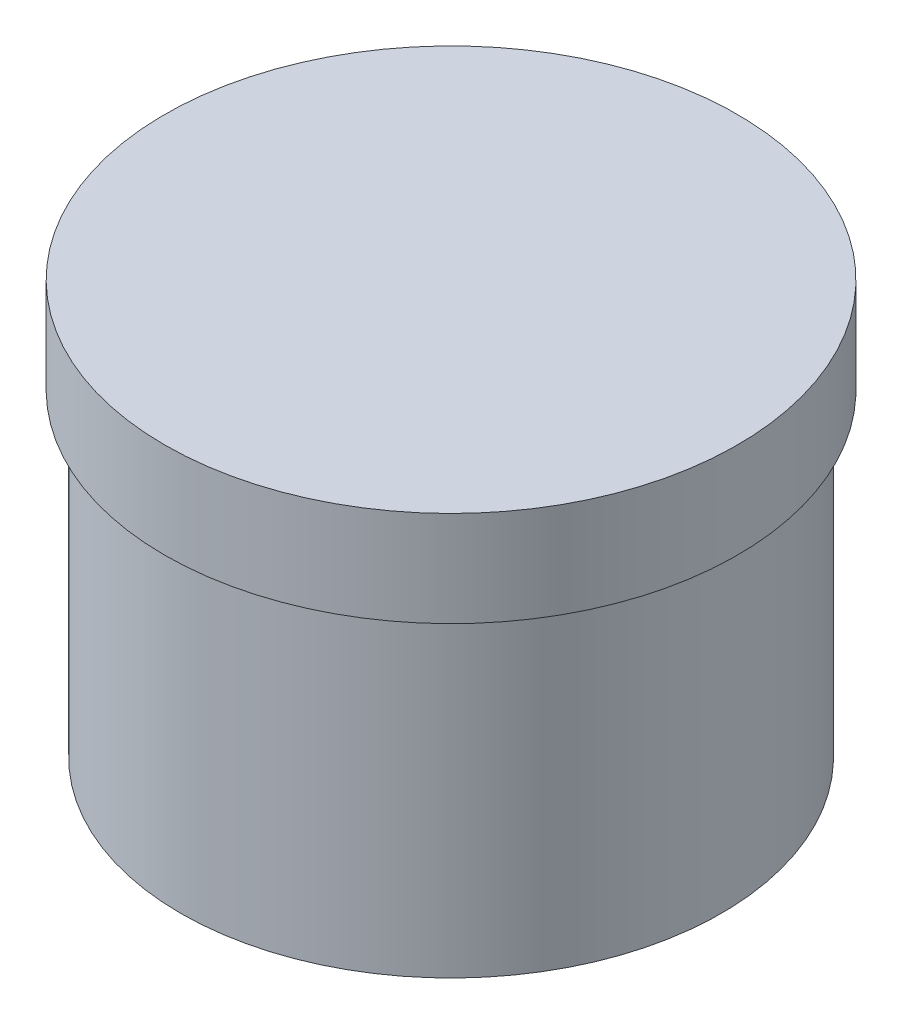
ISO-10303-21;
HEADER;
FILE_DESCRIPTION(('STEP AP214'),'2;1');
FILE_NAME('part.step','',(''),(''),'','','');
FILE_SCHEMA(('AUTOMOTIVE_DESIGN { 1 0 10303 214 1 1 1 1 }'));
ENDSEC;
DATA;
#1=APPLICATION_CONTEXT('core data for automotive mechanical design processes');
#2=APPLICATION_PROTOCOL_DEFINITION('international standard','automotive_design',2000,#1);
#3=PRODUCT_CONTEXT('',#1,'mechanical');
#4=PRODUCT('Part','Part','',(#3));
#5=PRODUCT_RELATED_PRODUCT_CATEGORY('part','',(#4));
#6=PRODUCT_DEFINITION_FORMATION('','',#4);
#7=PRODUCT_DEFINITION_CONTEXT('part definition',#1,'design');
#8=PRODUCT_DEFINITION('design','',#6,#7);
#9=PRODUCT_DEFINITION_SHAPE('','',#8);
#10=(LENGTH_UNIT() NAMED_UNIT(*) SI_UNIT(.MILLI.,.METRE.));
#11=(NAMED_UNIT(*) PLANE_ANGLE_UNIT() SI_UNIT($,.RADIAN.));
#12=(NAMED_UNIT(*) SI_UNIT($,.STERADIAN.) SOLID_ANGLE_UNIT());
#13=UNCERTAINTY_MEASURE_WITH_UNIT(LENGTH_MEASURE(1.E-05),#10,'distance_accuracy_value','');
#14=(GEOMETRIC_REPRESENTATION_CONTEXT(3) GLOBAL_UNCERTAINTY_ASSIGNED_CONTEXT((#13)) GLOBAL_UNIT_ASSIGNED_CONTEXT((#10,
#11,#12)) REPRESENTATION_CONTEXT('',''));
#15=CARTESIAN_POINT('',(0.,0.,0.));
#16=DIRECTION('',(0.,0.,1.));
#17=DIRECTION('',(1.,0.,0.));
#18=AXIS2_PLACEMENT_3D('',#15,#16,#17);
#19=CARTESIAN_POINT('',(0.,50.,0.));
#20=DIRECTION('',(0.,-1.,0.));
#21=DIRECTION('',(0.,0.,-1.));
#22=AXIS2_PLACEMENT_3D('',#19,#20,#21);
#23=CYLINDRICAL_SURFACE('',#22,42.5);
#24=CARTESIAN_POINT('',(0.,50.,0.));
#25=DIRECTION('',(0.,1.,0.));
#26=DIRECTION('',(0.,0.,1.));
#27=AXIS2_PLACEMENT_3D('',#24,#25,#26);
#28=CIRCLE('',#27,42.5);
#29=CARTESIAN_POINT('',(0.,50.,42.5));
#30=VERTEX_POINT('',#29);
#31=EDGE_CURVE('E10',#30,#30,#28,.T.);
#32=ORIENTED_EDGE('',*,*,#31,.F.);
#33=EDGE_LOOP('',(#32));
#34=FACE_BOUND('',#33,.T.);
#35=CARTESIAN_POINT('',(0.,0.,0.));
#36=DIRECTION('',(0.,1.,0.));
#37=DIRECTION('',(0.,0.,1.));
#38=AXIS2_PLACEMENT_3D('',#35,#36,#37);
#39=CIRCLE('',#38,42.5);
#40=CARTESIAN_POINT('',(0.,0.,42.5));
#41=VERTEX_POINT('',#40);
#42=EDGE_CURVE('E41',#41,#41,#39,.T.);
#43=ORIENTED_EDGE('',*,*,#42,.T.);
#44=EDGE_LOOP('',(#43));
#45=FACE_BOUND('',#44,.T.);
#46=ADVANCED_FACE('F38',(#34,#45),#23,.T.);
#47=CARTESIAN_POINT('',(0.,0.,0.));
#48=DIRECTION('',(0.,1.,0.));
#49=DIRECTION('',(0.,0.,1.));
#50=AXIS2_PLACEMENT_3D('',#47,#48,#49);
#51=PLANE('',#50);
#52=ORIENTED_EDGE('',*,*,#42,.F.);
#53=EDGE_LOOP('',(#52));
#54=FACE_BOUND('',#53,.T.);
#55=ADVANCED_FACE('F61',(#54),#51,.F.);
#56=CARTESIAN_POINT('',(0.,65.,0.));
#57=DIRECTION('',(0.,-1.,0.));
#58=DIRECTION('',(0.,0.,-1.));
#59=AXIS2_PLACEMENT_3D('',#56,#57,#58);
#60=CYLINDRICAL_SURFACE('',#59,45.);
#61=CARTESIAN_POINT('',(0.,65.,0.));
#62=DIRECTION('',(0.,1.,0.));
#63=DIRECTION('',(0.,0.,1.));
#64=AXIS2_PLACEMENT_3D('',#61,#62,#63);
#65=CIRCLE('',#64,45.);
#66=CARTESIAN_POINT('',(0.,65.,45.));
#67=VERTEX_POINT('',#66);
#68=EDGE_CURVE('E48',#67,#67,#65,.T.);
#69=ORIENTED_EDGE('',*,*,#68,.F.);
#70=EDGE_LOOP('',(#69));
#71=FACE_BOUND('',#70,.T.);
#72=CARTESIAN_POINT('',(0.,50.,0.));
#73=DIRECTION('',(0.,1.,0.));
#74=DIRECTION('',(0.,0.,1.));
#75=AXIS2_PLACEMENT_3D('',#72,#73,#74);
#76=CIRCLE('',#75,45.);
#77=CARTESIAN_POINT('',(0.,50.,45.));
#78=VERTEX_POINT('',#77);
#79=EDGE_CURVE('E50',#78,#78,#76,.T.);
#80=ORIENTED_EDGE('',*,*,#79,.T.);
#81=EDGE_LOOP('',(#80));
#82=FACE_BOUND('',#81,.T.);
#83=ADVANCED_FACE('F58',(#71,#82),#60,.T.);
#84=CARTESIAN_POINT('',(0.,65.,0.));
#85=DIRECTION('',(0.,1.,0.));
#86=DIRECTION('',(0.,0.,1.));
#87=AXIS2_PLACEMENT_3D('',#84,#85,#86);
#88=PLANE('',#87);
#89=ORIENTED_EDGE('',*,*,#68,.T.);
#90=EDGE_LOOP('',(#89));
#91=FACE_BOUND('',#90,.T.);
#92=ADVANCED_FACE('F56',(#91),#88,.T.);
#93=CARTESIAN_POINT('',(0.,50.,0.));
#94=DIRECTION('',(0.,1.,0.));
#95=DIRECTION('',(0.,0.,1.));
#96=AXIS2_PLACEMENT_3D('',#93,#94,#95);
#97=PLANE('',#96);
#98=ORIENTED_EDGE('',*,*,#31,.T.);
#99=EDGE_LOOP('',(#98));
#100=FACE_BOUND('',#99,.T.);
#101=ORIENTED_EDGE('',*,*,#79,.F.);
#102=EDGE_LOOP('',(#101));
#103=FACE_BOUND('',#102,.T.);
#104=ADVANCED_FACE('F65',(#100,#103),#97,.F.);
#105=CLOSED_SHELL('',(#46,#55,#83,#92,#104));
#106=MANIFOLD_SOLID_BREP('B2',#105);
#107=ADVANCED_BREP_SHAPE_REPRESENTATION('',(#18,#106),#14);
#108=SHAPE_DEFINITION_REPRESENTATION(#9,#107);
ENDSEC;
END-ISO-10303-21;
